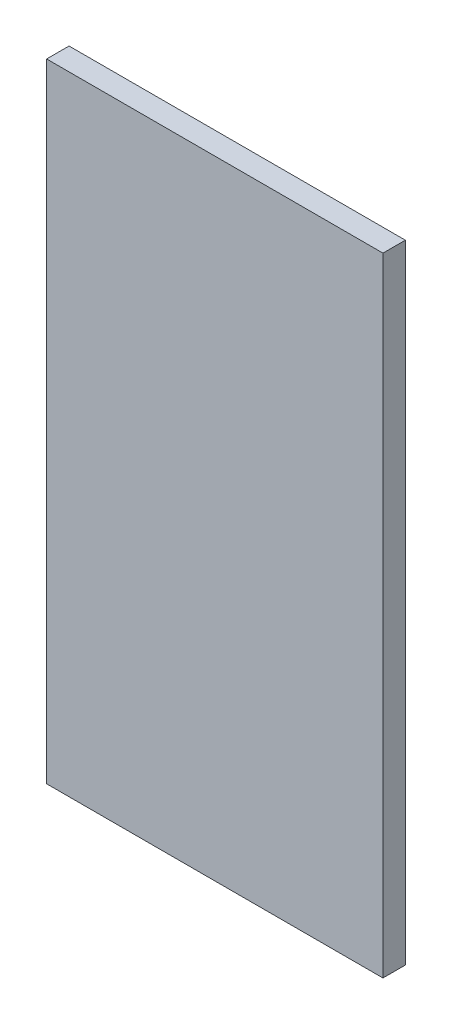
ISO-10303-21;
HEADER;
FILE_DESCRIPTION(('STEP AP214'),'2;1');
FILE_NAME('part.step','',(''),(''),'','','');
FILE_SCHEMA(('AUTOMOTIVE_DESIGN { 1 0 10303 214 1 1 1 1 }'));
ENDSEC;
DATA;
#1=APPLICATION_CONTEXT('core data for automotive mechanical design processes');
#2=APPLICATION_PROTOCOL_DEFINITION('international standard','automotive_design',2000,#1);
#3=PRODUCT_CONTEXT('',#1,'mechanical');
#4=PRODUCT('Part','Part','',(#3));
#5=PRODUCT_RELATED_PRODUCT_CATEGORY('part','',(#4));
#6=PRODUCT_DEFINITION_FORMATION('','',#4);
#7=PRODUCT_DEFINITION_CONTEXT('part definition',#1,'design');
#8=PRODUCT_DEFINITION('design','',#6,#7);
#9=PRODUCT_DEFINITION_SHAPE('','',#8);
#10=(LENGTH_UNIT() NAMED_UNIT(*) SI_UNIT(.MILLI.,.METRE.));
#11=(NAMED_UNIT(*) PLANE_ANGLE_UNIT() SI_UNIT($,.RADIAN.));
#12=(NAMED_UNIT(*) SI_UNIT($,.STERADIAN.) SOLID_ANGLE_UNIT());
#13=UNCERTAINTY_MEASURE_WITH_UNIT(LENGTH_MEASURE(1.E-05),#10,'distance_accuracy_value','');
#14=(GEOMETRIC_REPRESENTATION_CONTEXT(3) GLOBAL_UNCERTAINTY_ASSIGNED_CONTEXT((#13)) GLOBAL_UNIT_ASSIGNED_CONTEXT((#10,
#11,#12)) REPRESENTATION_CONTEXT('',''));
#15=CARTESIAN_POINT('',(0.,0.,0.));
#16=DIRECTION('',(0.,0.,1.));
#17=DIRECTION('',(1.,0.,0.));
#18=AXIS2_PLACEMENT_3D('',#15,#16,#17);
#19=CARTESIAN_POINT('',(0.,0.,6.35));
#20=DIRECTION('',(1.,0.,0.));
#21=DIRECTION('',(0.,0.,-1.));
#22=AXIS2_PLACEMENT_3D('',#19,#20,#21);
#23=PLANE('',#22);
#24=DIRECTION('',(0.,-1.,0.));
#25=VECTOR('',#24,1.);
#26=CARTESIAN_POINT('',(0.,0.,0.));
#27=LINE('',#26,#25);
#28=CARTESIAN_POINT('',(0.,177.8,0.));
#29=VERTEX_POINT('',#28);
#30=CARTESIAN_POINT('',(0.,0.,0.));
#31=VERTEX_POINT('',#30);
#32=EDGE_CURVE('E96',#29,#31,#27,.T.);
#33=ORIENTED_EDGE('',*,*,#32,.T.);
#34=DIRECTION('',(0.,0.,-1.));
#35=VECTOR('',#34,1.);
#36=CARTESIAN_POINT('',(0.,0.,6.35));
#37=LINE('',#36,#35);
#38=CARTESIAN_POINT('',(0.,0.,6.35));
#39=VERTEX_POINT('',#38);
#40=EDGE_CURVE('E11',#39,#31,#37,.T.);
#41=ORIENTED_EDGE('',*,*,#40,.F.);
#42=DIRECTION('',(0.,-1.,0.));
#43=VECTOR('',#42,1.);
#44=CARTESIAN_POINT('',(0.,0.,6.35));
#45=LINE('',#44,#43);
#46=CARTESIAN_POINT('',(0.,177.8,6.35));
#47=VERTEX_POINT('',#46);
#48=EDGE_CURVE('E84',#47,#39,#45,.T.);
#49=ORIENTED_EDGE('',*,*,#48,.F.);
#50=DIRECTION('',(0.,0.,-1.));
#51=VECTOR('',#50,1.);
#52=CARTESIAN_POINT('',(0.,177.8,6.35));
#53=LINE('',#52,#51);
#54=EDGE_CURVE('E92',#47,#29,#53,.T.);
#55=ORIENTED_EDGE('',*,*,#54,.T.);
#56=EDGE_LOOP('',(#33,#41,#49,#55));
#57=FACE_BOUND('',#56,.T.);
#58=ADVANCED_FACE('F33',(#57),#23,.F.);
#59=CARTESIAN_POINT('',(0.,0.,6.35));
#60=DIRECTION('',(0.,1.,0.));
#61=DIRECTION('',(0.,0.,1.));
#62=AXIS2_PLACEMENT_3D('',#59,#60,#61);
#63=PLANE('',#62);
#64=DIRECTION('',(1.,0.,0.));
#65=VECTOR('',#64,1.);
#66=CARTESIAN_POINT('',(0.,0.,0.));
#67=LINE('',#66,#65);
#68=CARTESIAN_POINT('',(95.25,0.,0.));
#69=VERTEX_POINT('',#68);
#70=EDGE_CURVE('E88',#31,#69,#67,.T.);
#71=ORIENTED_EDGE('',*,*,#70,.T.);
#72=DIRECTION('',(0.,0.,-1.));
#73=VECTOR('',#72,1.);
#74=CARTESIAN_POINT('',(95.25,0.,6.35));
#75=LINE('',#74,#73);
#76=CARTESIAN_POINT('',(95.25,0.,6.35));
#77=VERTEX_POINT('',#76);
#78=EDGE_CURVE('E41',#77,#69,#75,.T.);
#79=ORIENTED_EDGE('',*,*,#78,.F.);
#80=DIRECTION('',(1.,0.,0.));
#81=VECTOR('',#80,1.);
#82=CARTESIAN_POINT('',(0.,0.,6.35));
#83=LINE('',#82,#81);
#84=EDGE_CURVE('E79',#39,#77,#83,.T.);
#85=ORIENTED_EDGE('',*,*,#84,.F.);
#86=ORIENTED_EDGE('',*,*,#40,.T.);
#87=EDGE_LOOP('',(#71,#79,#85,#86));
#88=FACE_BOUND('',#87,.T.);
#89=ADVANCED_FACE('F87',(#88),#63,.F.);
#90=CARTESIAN_POINT('',(95.25,0.,6.35));
#91=DIRECTION('',(-1.,0.,0.));
#92=DIRECTION('',(0.,0.,1.));
#93=AXIS2_PLACEMENT_3D('',#90,#91,#92);
#94=PLANE('',#93);
#95=DIRECTION('',(0.,1.,0.));
#96=VECTOR('',#95,1.);
#97=CARTESIAN_POINT('',(95.25,0.,0.));
#98=LINE('',#97,#96);
#99=CARTESIAN_POINT('',(95.25,177.8,0.));
#100=VERTEX_POINT('',#99);
#101=EDGE_CURVE('E66',#69,#100,#98,.T.);
#102=ORIENTED_EDGE('',*,*,#101,.T.);
#103=DIRECTION('',(0.,0.,-1.));
#104=VECTOR('',#103,1.);
#105=CARTESIAN_POINT('',(95.25,177.8,6.35));
#106=LINE('',#105,#104);
#107=CARTESIAN_POINT('',(95.25,177.8,6.35));
#108=VERTEX_POINT('',#107);
#109=EDGE_CURVE('E89',#108,#100,#106,.T.);
#110=ORIENTED_EDGE('',*,*,#109,.F.);
#111=DIRECTION('',(0.,1.,0.));
#112=VECTOR('',#111,1.);
#113=CARTESIAN_POINT('',(95.25,0.,6.35));
#114=LINE('',#113,#112);
#115=EDGE_CURVE('E82',#77,#108,#114,.T.);
#116=ORIENTED_EDGE('',*,*,#115,.F.);
#117=ORIENTED_EDGE('',*,*,#78,.T.);
#118=EDGE_LOOP('',(#102,#110,#116,#117));
#119=FACE_BOUND('',#118,.T.);
#120=ADVANCED_FACE('F90',(#119),#94,.F.);
#121=CARTESIAN_POINT('',(0.,177.8,6.35));
#122=DIRECTION('',(0.,-1.,0.));
#123=DIRECTION('',(0.,0.,-1.));
#124=AXIS2_PLACEMENT_3D('',#121,#122,#123);
#125=PLANE('',#124);
#126=DIRECTION('',(-1.,0.,0.));
#127=VECTOR('',#126,1.);
#128=CARTESIAN_POINT('',(0.,177.8,0.));
#129=LINE('',#128,#127);
#130=EDGE_CURVE('E72',#100,#29,#129,.T.);
#131=ORIENTED_EDGE('',*,*,#130,.T.);
#132=ORIENTED_EDGE('',*,*,#54,.F.);
#133=DIRECTION('',(-1.,0.,0.));
#134=VECTOR('',#133,1.);
#135=CARTESIAN_POINT('',(0.,177.8,6.35));
#136=LINE('',#135,#134);
#137=EDGE_CURVE('E49',#108,#47,#136,.T.);
#138=ORIENTED_EDGE('',*,*,#137,.F.);
#139=ORIENTED_EDGE('',*,*,#109,.T.);
#140=EDGE_LOOP('',(#131,#132,#138,#139));
#141=FACE_BOUND('',#140,.T.);
#142=ADVANCED_FACE('F103',(#141),#125,.F.);
#143=CARTESIAN_POINT('',(0.,0.,6.35));
#144=DIRECTION('',(0.,0.,-1.));
#145=DIRECTION('',(-1.,0.,0.));
#146=AXIS2_PLACEMENT_3D('',#143,#144,#145);
#147=PLANE('',#146);
#148=ORIENTED_EDGE('',*,*,#48,.T.);
#149=ORIENTED_EDGE('',*,*,#84,.T.);
#150=ORIENTED_EDGE('',*,*,#115,.T.);
#151=ORIENTED_EDGE('',*,*,#137,.T.);
#152=EDGE_LOOP('',(#148,#149,#150,#151));
#153=FACE_BOUND('',#152,.T.);
#154=ADVANCED_FACE('F80',(#153),#147,.F.);
#155=CARTESIAN_POINT('',(0.,0.,0.));
#156=DIRECTION('',(0.,0.,-1.));
#157=DIRECTION('',(-1.,0.,0.));
#158=AXIS2_PLACEMENT_3D('',#155,#156,#157);
#159=PLANE('',#158);
#160=ORIENTED_EDGE('',*,*,#32,.F.);
#161=ORIENTED_EDGE('',*,*,#130,.F.);
#162=ORIENTED_EDGE('',*,*,#101,.F.);
#163=ORIENTED_EDGE('',*,*,#70,.F.);
#164=EDGE_LOOP('',(#160,#161,#162,#163));
#165=FACE_BOUND('',#164,.T.);
#166=ADVANCED_FACE('F106',(#165),#159,.T.);
#167=CLOSED_SHELL('',(#58,#89,#120,#142,#154,#166));
#168=MANIFOLD_SOLID_BREP('B2',#167);
#169=ADVANCED_BREP_SHAPE_REPRESENTATION('',(#18,#168),#14);
#170=SHAPE_DEFINITION_REPRESENTATION(#9,#169);
ENDSEC;
END-ISO-10303-21;
